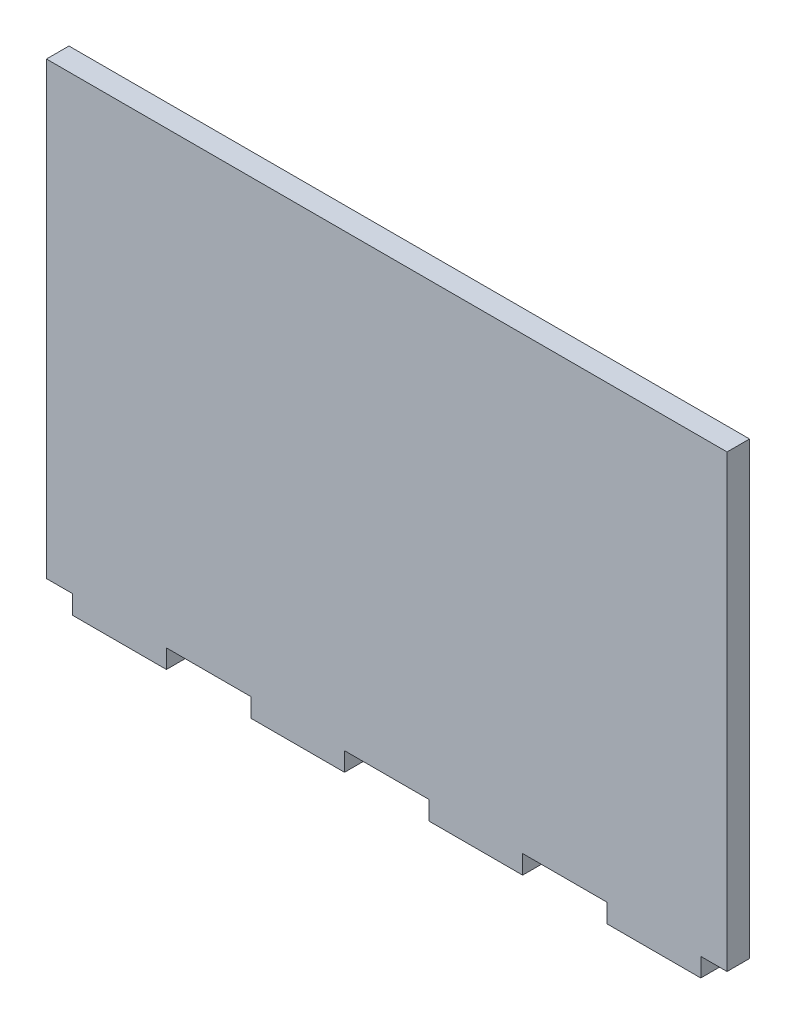
ISO-10303-21;
HEADER;
FILE_DESCRIPTION(('STEP AP214'),'2;1');
FILE_NAME('part.step','',(''),(''),'','','');
FILE_SCHEMA(('AUTOMOTIVE_DESIGN { 1 0 10303 214 1 1 1 1 }'));
ENDSEC;
DATA;
#1=APPLICATION_CONTEXT('core data for automotive mechanical design processes');
#2=APPLICATION_PROTOCOL_DEFINITION('international standard','automotive_design',2000,#1);
#3=PRODUCT_CONTEXT('',#1,'mechanical');
#4=PRODUCT('Part','Part','',(#3));
#5=PRODUCT_RELATED_PRODUCT_CATEGORY('part','',(#4));
#6=PRODUCT_DEFINITION_FORMATION('','',#4);
#7=PRODUCT_DEFINITION_CONTEXT('part definition',#1,'design');
#8=PRODUCT_DEFINITION('design','',#6,#7);
#9=PRODUCT_DEFINITION_SHAPE('','',#8);
#10=(LENGTH_UNIT() NAMED_UNIT(*) SI_UNIT(.MILLI.,.METRE.));
#11=(NAMED_UNIT(*) PLANE_ANGLE_UNIT() SI_UNIT($,.RADIAN.));
#12=(NAMED_UNIT(*) SI_UNIT($,.STERADIAN.) SOLID_ANGLE_UNIT());
#13=UNCERTAINTY_MEASURE_WITH_UNIT(LENGTH_MEASURE(1.E-05),#10,'distance_accuracy_value','');
#14=(GEOMETRIC_REPRESENTATION_CONTEXT(3) GLOBAL_UNCERTAINTY_ASSIGNED_CONTEXT((#13)) GLOBAL_UNIT_ASSIGNED_CONTEXT((#10,
#11,#12)) REPRESENTATION_CONTEXT('',''));
#15=CARTESIAN_POINT('',(0.,0.,0.));
#16=DIRECTION('',(0.,0.,1.));
#17=DIRECTION('',(1.,0.,0.));
#18=AXIS2_PLACEMENT_3D('',#15,#16,#17);
#19=CARTESIAN_POINT('',(64.4599453271027,0.,6.));
#20=DIRECTION('',(1.,0.,0.));
#21=DIRECTION('',(0.,1.,0.));
#22=AXIS2_PLACEMENT_3D('',#19,#20,#21);
#23=PLANE('',#22);
#24=DIRECTION('',(0.,-1.,0.));
#25=VECTOR('',#24,1.);
#26=CARTESIAN_POINT('',(64.4599453271027,0.,0.));
#27=LINE('',#26,#25);
#28=CARTESIAN_POINT('',(64.4599453271027,98.2674,0.));
#29=VERTEX_POINT('',#28);
#30=CARTESIAN_POINT('',(64.4599453271027,-21.7326,0.));
#31=VERTEX_POINT('',#30);
#32=EDGE_CURVE('E201',#29,#31,#27,.T.);
#33=ORIENTED_EDGE('',*,*,#32,.F.);
#34=DIRECTION('',(0.,0.,-1.));
#35=VECTOR('',#34,1.);
#36=CARTESIAN_POINT('',(64.4599453271027,98.2674,6.));
#37=LINE('',#36,#35);
#38=CARTESIAN_POINT('',(64.4599453271027,98.2674,6.));
#39=VERTEX_POINT('',#38);
#40=EDGE_CURVE('E11',#39,#29,#37,.T.);
#41=ORIENTED_EDGE('',*,*,#40,.F.);
#42=DIRECTION('',(0.,-1.,0.));
#43=VECTOR('',#42,1.);
#44=CARTESIAN_POINT('',(64.4599453271027,0.,6.));
#45=LINE('',#44,#43);
#46=CARTESIAN_POINT('',(64.4599453271027,-21.7326,6.));
#47=VERTEX_POINT('',#46);
#48=EDGE_CURVE('E298',#39,#47,#45,.T.);
#49=ORIENTED_EDGE('',*,*,#48,.T.);
#50=DIRECTION('',(0.,0.,-1.));
#51=VECTOR('',#50,1.);
#52=CARTESIAN_POINT('',(64.4599453271027,-21.7326,6.));
#53=LINE('',#52,#51);
#54=EDGE_CURVE('E120',#47,#31,#53,.T.);
#55=ORIENTED_EDGE('',*,*,#54,.T.);
#56=EDGE_LOOP('',(#33,#41,#49,#55));
#57=FACE_BOUND('',#56,.T.);
#58=ADVANCED_FACE('F34',(#57),#23,.T.);
#59=CARTESIAN_POINT('',(0.,98.2674,6.));
#60=DIRECTION('',(0.,1.,0.));
#61=DIRECTION('',(0.,0.,1.));
#62=AXIS2_PLACEMENT_3D('',#59,#60,#61);
#63=PLANE('',#62);
#64=DIRECTION('',(1.,0.,0.));
#65=VECTOR('',#64,1.);
#66=CARTESIAN_POINT('',(0.,98.2674,0.));
#67=LINE('',#66,#65);
#68=CARTESIAN_POINT('',(-117.040054672897,98.2674,0.));
#69=VERTEX_POINT('',#68);
#70=EDGE_CURVE('E204',#69,#29,#67,.T.);
#71=ORIENTED_EDGE('',*,*,#70,.F.);
#72=DIRECTION('',(0.,0.,-1.));
#73=VECTOR('',#72,1.);
#74=CARTESIAN_POINT('',(-117.040054672897,98.2674,6.));
#75=LINE('',#74,#73);
#76=CARTESIAN_POINT('',(-117.040054672897,98.2674,6.));
#77=VERTEX_POINT('',#76);
#78=EDGE_CURVE('E42',#77,#69,#75,.T.);
#79=ORIENTED_EDGE('',*,*,#78,.F.);
#80=DIRECTION('',(1.,0.,0.));
#81=VECTOR('',#80,1.);
#82=CARTESIAN_POINT('',(0.,98.2674,6.));
#83=LINE('',#82,#81);
#84=EDGE_CURVE('E297',#77,#39,#83,.T.);
#85=ORIENTED_EDGE('',*,*,#84,.T.);
#86=ORIENTED_EDGE('',*,*,#40,.T.);
#87=EDGE_LOOP('',(#71,#79,#85,#86));
#88=FACE_BOUND('',#87,.T.);
#89=ADVANCED_FACE('F296',(#88),#63,.T.);
#90=CARTESIAN_POINT('',(-117.040054672897,0.,6.));
#91=DIRECTION('',(1.,0.,0.));
#92=DIRECTION('',(0.,0.,-1.));
#93=AXIS2_PLACEMENT_3D('',#90,#91,#92);
#94=PLANE('',#93);
#95=DIRECTION('',(0.,-1.,0.));
#96=VECTOR('',#95,1.);
#97=CARTESIAN_POINT('',(-117.040054672897,0.,0.));
#98=LINE('',#97,#96);
#99=CARTESIAN_POINT('',(-117.040054672897,-21.7326,0.));
#100=VERTEX_POINT('',#99);
#101=EDGE_CURVE('E207',#69,#100,#98,.T.);
#102=ORIENTED_EDGE('',*,*,#101,.T.);
#103=DIRECTION('',(0.,0.,-1.));
#104=VECTOR('',#103,1.);
#105=CARTESIAN_POINT('',(-117.040054672897,-21.7326,6.));
#106=LINE('',#105,#104);
#107=CARTESIAN_POINT('',(-117.040054672897,-21.7326,6.));
#108=VERTEX_POINT('',#107);
#109=EDGE_CURVE('E280',#108,#100,#106,.T.);
#110=ORIENTED_EDGE('',*,*,#109,.F.);
#111=DIRECTION('',(0.,-1.,0.));
#112=VECTOR('',#111,1.);
#113=CARTESIAN_POINT('',(-117.040054672897,0.,6.));
#114=LINE('',#113,#112);
#115=EDGE_CURVE('E287',#77,#108,#114,.T.);
#116=ORIENTED_EDGE('',*,*,#115,.F.);
#117=ORIENTED_EDGE('',*,*,#78,.T.);
#118=EDGE_LOOP('',(#102,#110,#116,#117));
#119=FACE_BOUND('',#118,.T.);
#120=ADVANCED_FACE('F285',(#119),#94,.F.);
#121=CARTESIAN_POINT('',(0.,-21.7326,6.));
#122=DIRECTION('',(0.,1.,0.));
#123=DIRECTION('',(-1.,0.,0.));
#124=AXIS2_PLACEMENT_3D('',#121,#122,#123);
#125=PLANE('',#124);
#126=DIRECTION('',(1.,0.,0.));
#127=VECTOR('',#126,1.);
#128=CARTESIAN_POINT('',(0.,-21.7326,0.));
#129=LINE('',#128,#127);
#130=CARTESIAN_POINT('',(-110.030054672897,-21.7326,0.));
#131=VERTEX_POINT('',#130);
#132=EDGE_CURVE('E209',#100,#131,#129,.T.);
#133=ORIENTED_EDGE('',*,*,#132,.T.);
#134=DIRECTION('',(0.,0.,-1.));
#135=VECTOR('',#134,1.);
#136=CARTESIAN_POINT('',(-110.030054672897,-21.7326,6.));
#137=LINE('',#136,#135);
#138=CARTESIAN_POINT('',(-110.030054672897,-21.7326,6.));
#139=VERTEX_POINT('',#138);
#140=EDGE_CURVE('E277',#139,#131,#137,.T.);
#141=ORIENTED_EDGE('',*,*,#140,.F.);
#142=DIRECTION('',(1.,0.,0.));
#143=VECTOR('',#142,1.);
#144=CARTESIAN_POINT('',(0.,-21.7326,6.));
#145=LINE('',#144,#143);
#146=EDGE_CURVE('E198',#108,#139,#145,.T.);
#147=ORIENTED_EDGE('',*,*,#146,.F.);
#148=ORIENTED_EDGE('',*,*,#109,.T.);
#149=EDGE_LOOP('',(#133,#141,#147,#148));
#150=FACE_BOUND('',#149,.T.);
#151=ADVANCED_FACE('F355',(#150),#125,.F.);
#152=CARTESIAN_POINT('',(-110.030054672897,0.,6.));
#153=DIRECTION('',(1.,0.,0.));
#154=DIRECTION('',(0.,0.,-1.));
#155=AXIS2_PLACEMENT_3D('',#152,#153,#154);
#156=PLANE('',#155);
#157=DIRECTION('',(0.,-1.,0.));
#158=VECTOR('',#157,1.);
#159=CARTESIAN_POINT('',(-110.030054672897,0.,0.));
#160=LINE('',#159,#158);
#161=CARTESIAN_POINT('',(-110.030054672897,-26.7326,0.));
#162=VERTEX_POINT('',#161);
#163=EDGE_CURVE('E211',#131,#162,#160,.T.);
#164=ORIENTED_EDGE('',*,*,#163,.T.);
#165=DIRECTION('',(0.,0.,-1.));
#166=VECTOR('',#165,1.);
#167=CARTESIAN_POINT('',(-110.030054672897,-26.7326,6.));
#168=LINE('',#167,#166);
#169=CARTESIAN_POINT('',(-110.030054672897,-26.7326,6.));
#170=VERTEX_POINT('',#169);
#171=EDGE_CURVE('E274',#170,#162,#168,.T.);
#172=ORIENTED_EDGE('',*,*,#171,.F.);
#173=DIRECTION('',(0.,-1.,0.));
#174=VECTOR('',#173,1.);
#175=CARTESIAN_POINT('',(-110.030054672897,0.,6.));
#176=LINE('',#175,#174);
#177=EDGE_CURVE('E350',#139,#170,#176,.T.);
#178=ORIENTED_EDGE('',*,*,#177,.F.);
#179=ORIENTED_EDGE('',*,*,#140,.T.);
#180=EDGE_LOOP('',(#164,#172,#178,#179));
#181=FACE_BOUND('',#180,.T.);
#182=ADVANCED_FACE('F359',(#181),#156,.F.);
#183=CARTESIAN_POINT('',(0.,-26.7326,6.));
#184=DIRECTION('',(0.,1.,0.));
#185=DIRECTION('',(0.,0.,1.));
#186=AXIS2_PLACEMENT_3D('',#183,#184,#185);
#187=PLANE('',#186);
#188=DIRECTION('',(1.,0.,0.));
#189=VECTOR('',#188,1.);
#190=CARTESIAN_POINT('',(0.,-26.7326,0.));
#191=LINE('',#190,#189);
#192=CARTESIAN_POINT('',(-85.0500546728973,-26.7326,0.));
#193=VERTEX_POINT('',#192);
#194=EDGE_CURVE('E215',#162,#193,#191,.T.);
#195=ORIENTED_EDGE('',*,*,#194,.T.);
#196=DIRECTION('',(0.,0.,-1.));
#197=VECTOR('',#196,1.);
#198=CARTESIAN_POINT('',(-85.0500546728973,-26.7326,6.));
#199=LINE('',#198,#197);
#200=CARTESIAN_POINT('',(-85.0500546728973,-26.7326,6.));
#201=VERTEX_POINT('',#200);
#202=EDGE_CURVE('E272',#201,#193,#199,.T.);
#203=ORIENTED_EDGE('',*,*,#202,.F.);
#204=DIRECTION('',(1.,0.,0.));
#205=VECTOR('',#204,1.);
#206=CARTESIAN_POINT('',(0.,-26.7326,6.));
#207=LINE('',#206,#205);
#208=EDGE_CURVE('E349',#170,#201,#207,.T.);
#209=ORIENTED_EDGE('',*,*,#208,.F.);
#210=ORIENTED_EDGE('',*,*,#171,.T.);
#211=EDGE_LOOP('',(#195,#203,#209,#210));
#212=FACE_BOUND('',#211,.T.);
#213=ADVANCED_FACE('F364',(#212),#187,.F.);
#214=CARTESIAN_POINT('',(-85.0500546728972,2.36061322358697E-13,6.));
#215=DIRECTION('',(1.,0.,0.));
#216=DIRECTION('',(0.,1.,0.));
#217=AXIS2_PLACEMENT_3D('',#214,#215,#216);
#218=PLANE('',#217);
#219=DIRECTION('',(0.,-1.,0.));
#220=VECTOR('',#219,1.);
#221=CARTESIAN_POINT('',(-85.0500546728972,2.36061322358697E-13,0.));
#222=LINE('',#221,#220);
#223=CARTESIAN_POINT('',(-85.0500546728973,-21.7326,0.));
#224=VERTEX_POINT('',#223);
#225=EDGE_CURVE('E218',#224,#193,#222,.T.);
#226=ORIENTED_EDGE('',*,*,#225,.F.);
#227=DIRECTION('',(0.,0.,-1.));
#228=VECTOR('',#227,1.);
#229=CARTESIAN_POINT('',(-85.0500546728973,-21.7326,6.));
#230=LINE('',#229,#228);
#231=CARTESIAN_POINT('',(-85.0500546728973,-21.7326,6.));
#232=VERTEX_POINT('',#231);
#233=EDGE_CURVE('E270',#232,#224,#230,.T.);
#234=ORIENTED_EDGE('',*,*,#233,.F.);
#235=DIRECTION('',(0.,-1.,0.));
#236=VECTOR('',#235,1.);
#237=CARTESIAN_POINT('',(-85.0500546728972,2.36061322358697E-13,6.));
#238=LINE('',#237,#236);
#239=EDGE_CURVE('E346',#232,#201,#238,.T.);
#240=ORIENTED_EDGE('',*,*,#239,.T.);
#241=ORIENTED_EDGE('',*,*,#202,.T.);
#242=EDGE_LOOP('',(#226,#234,#240,#241));
#243=FACE_BOUND('',#242,.T.);
#244=ADVANCED_FACE('F367',(#243),#218,.T.);
#245=CARTESIAN_POINT('',(-62.5300546728973,-21.7326,0.));
#246=VERTEX_POINT('',#245);
#247=EDGE_CURVE('E213',#224,#246,#129,.T.);
#248=ORIENTED_EDGE('',*,*,#247,.T.);
#249=DIRECTION('',(0.,0.,-1.));
#250=VECTOR('',#249,1.);
#251=CARTESIAN_POINT('',(-62.5300546728973,-21.7326,6.));
#252=LINE('',#251,#250);
#253=CARTESIAN_POINT('',(-62.5300546728973,-21.7326,6.));
#254=VERTEX_POINT('',#253);
#255=EDGE_CURVE('E267',#254,#246,#252,.T.);
#256=ORIENTED_EDGE('',*,*,#255,.F.);
#257=EDGE_CURVE('E331',#232,#254,#145,.T.);
#258=ORIENTED_EDGE('',*,*,#257,.F.);
#259=ORIENTED_EDGE('',*,*,#233,.T.);
#260=EDGE_LOOP('',(#248,#256,#258,#259));
#261=FACE_BOUND('',#260,.T.);
#262=ADVANCED_FACE('F309',(#261),#125,.F.);
#263=CARTESIAN_POINT('',(-62.5300546728973,0.,6.));
#264=DIRECTION('',(1.,0.,0.));
#265=DIRECTION('',(0.,0.,-1.));
#266=AXIS2_PLACEMENT_3D('',#263,#264,#265);
#267=PLANE('',#266);
#268=DIRECTION('',(0.,-1.,0.));
#269=VECTOR('',#268,1.);
#270=CARTESIAN_POINT('',(-62.5300546728973,0.,0.));
#271=LINE('',#270,#269);
#272=CARTESIAN_POINT('',(-62.5300546728973,-26.7326,0.));
#273=VERTEX_POINT('',#272);
#274=EDGE_CURVE('E221',#246,#273,#271,.T.);
#275=ORIENTED_EDGE('',*,*,#274,.T.);
#276=DIRECTION('',(0.,0.,-1.));
#277=VECTOR('',#276,1.);
#278=CARTESIAN_POINT('',(-62.5300546728973,-26.7326,6.));
#279=LINE('',#278,#277);
#280=CARTESIAN_POINT('',(-62.5300546728973,-26.7326,6.));
#281=VERTEX_POINT('',#280);
#282=EDGE_CURVE('E264',#281,#273,#279,.T.);
#283=ORIENTED_EDGE('',*,*,#282,.F.);
#284=DIRECTION('',(0.,-1.,0.));
#285=VECTOR('',#284,1.);
#286=CARTESIAN_POINT('',(-62.5300546728973,0.,6.));
#287=LINE('',#286,#285);
#288=EDGE_CURVE('E317',#254,#281,#287,.T.);
#289=ORIENTED_EDGE('',*,*,#288,.F.);
#290=ORIENTED_EDGE('',*,*,#255,.T.);
#291=EDGE_LOOP('',(#275,#283,#289,#290));
#292=FACE_BOUND('',#291,.T.);
#293=ADVANCED_FACE('F315',(#292),#267,.F.);
#294=CARTESIAN_POINT('',(0.,-26.7326,6.));
#295=DIRECTION('',(0.,1.,0.));
#296=DIRECTION('',(0.,0.,1.));
#297=AXIS2_PLACEMENT_3D('',#294,#295,#296);
#298=PLANE('',#297);
#299=DIRECTION('',(1.,0.,0.));
#300=VECTOR('',#299,1.);
#301=CARTESIAN_POINT('',(0.,-26.7326,0.));
#302=LINE('',#301,#300);
#303=CARTESIAN_POINT('',(-37.5500546728973,-26.7326,0.));
#304=VERTEX_POINT('',#303);
#305=EDGE_CURVE('E223',#273,#304,#302,.T.);
#306=ORIENTED_EDGE('',*,*,#305,.T.);
#307=DIRECTION('',(0.,0.,-1.));
#308=VECTOR('',#307,1.);
#309=CARTESIAN_POINT('',(-37.5500546728973,-26.7326,6.));
#310=LINE('',#309,#308);
#311=CARTESIAN_POINT('',(-37.5500546728973,-26.7326,6.));
#312=VERTEX_POINT('',#311);
#313=EDGE_CURVE('E262',#312,#304,#310,.T.);
#314=ORIENTED_EDGE('',*,*,#313,.F.);
#315=DIRECTION('',(1.,0.,0.));
#316=VECTOR('',#315,1.);
#317=CARTESIAN_POINT('',(0.,-26.7326,6.));
#318=LINE('',#317,#316);
#319=EDGE_CURVE('E325',#281,#312,#318,.T.);
#320=ORIENTED_EDGE('',*,*,#319,.F.);
#321=ORIENTED_EDGE('',*,*,#282,.T.);
#322=EDGE_LOOP('',(#306,#314,#320,#321));
#323=FACE_BOUND('',#322,.T.);
#324=ADVANCED_FACE('F322',(#323),#298,.F.);
#325=CARTESIAN_POINT('',(-37.5500546728973,0.,6.));
#326=DIRECTION('',(1.,0.,0.));
#327=DIRECTION('',(0.,1.,0.));
#328=AXIS2_PLACEMENT_3D('',#325,#326,#327);
#329=PLANE('',#328);
#330=DIRECTION('',(0.,-1.,0.));
#331=VECTOR('',#330,1.);
#332=CARTESIAN_POINT('',(-37.5500546728973,0.,0.));
#333=LINE('',#332,#331);
#334=CARTESIAN_POINT('',(-37.5500546728973,-21.7326,0.));
#335=VERTEX_POINT('',#334);
#336=EDGE_CURVE('E226',#335,#304,#333,.T.);
#337=ORIENTED_EDGE('',*,*,#336,.F.);
#338=DIRECTION('',(0.,0.,-1.));
#339=VECTOR('',#338,1.);
#340=CARTESIAN_POINT('',(-37.5500546728973,-21.7326,6.));
#341=LINE('',#340,#339);
#342=CARTESIAN_POINT('',(-37.5500546728973,-21.7326,6.));
#343=VERTEX_POINT('',#342);
#344=EDGE_CURVE('E260',#343,#335,#341,.T.);
#345=ORIENTED_EDGE('',*,*,#344,.F.);
#346=DIRECTION('',(0.,-1.,0.));
#347=VECTOR('',#346,1.);
#348=CARTESIAN_POINT('',(-37.5500546728973,0.,6.));
#349=LINE('',#348,#347);
#350=EDGE_CURVE('E327',#343,#312,#349,.T.);
#351=ORIENTED_EDGE('',*,*,#350,.T.);
#352=ORIENTED_EDGE('',*,*,#313,.T.);
#353=EDGE_LOOP('',(#337,#345,#351,#352));
#354=FACE_BOUND('',#353,.T.);
#355=ADVANCED_FACE('F417',(#354),#329,.T.);
#356=CARTESIAN_POINT('',(-15.0300546728973,-21.7326,0.));
#357=VERTEX_POINT('',#356);
#358=EDGE_CURVE('E229',#335,#357,#129,.T.);
#359=ORIENTED_EDGE('',*,*,#358,.T.);
#360=DIRECTION('',(0.,0.,-1.));
#361=VECTOR('',#360,1.);
#362=CARTESIAN_POINT('',(-15.0300546728973,-21.7326,6.));
#363=LINE('',#362,#361);
#364=CARTESIAN_POINT('',(-15.0300546728973,-21.7326,6.));
#365=VERTEX_POINT('',#364);
#366=EDGE_CURVE('E257',#365,#357,#363,.T.);
#367=ORIENTED_EDGE('',*,*,#366,.F.);
#368=EDGE_CURVE('E329',#343,#365,#145,.T.);
#369=ORIENTED_EDGE('',*,*,#368,.F.);
#370=ORIENTED_EDGE('',*,*,#344,.T.);
#371=EDGE_LOOP('',(#359,#367,#369,#370));
#372=FACE_BOUND('',#371,.T.);
#373=ADVANCED_FACE('F375',(#372),#125,.F.);
#374=CARTESIAN_POINT('',(-15.0300546728973,0.,6.));
#375=DIRECTION('',(1.,0.,0.));
#376=DIRECTION('',(0.,1.,0.));
#377=AXIS2_PLACEMENT_3D('',#374,#375,#376);
#378=PLANE('',#377);
#379=DIRECTION('',(0.,-1.,0.));
#380=VECTOR('',#379,1.);
#381=CARTESIAN_POINT('',(-15.0300546728973,0.,0.));
#382=LINE('',#381,#380);
#383=CARTESIAN_POINT('',(-15.0300546728973,-26.7326,0.));
#384=VERTEX_POINT('',#383);
#385=EDGE_CURVE('E230',#357,#384,#382,.T.);
#386=ORIENTED_EDGE('',*,*,#385,.T.);
#387=DIRECTION('',(0.,0.,-1.));
#388=VECTOR('',#387,1.);
#389=CARTESIAN_POINT('',(-15.0300546728973,-26.7326,6.));
#390=LINE('',#389,#388);
#391=CARTESIAN_POINT('',(-15.0300546728973,-26.7326,6.));
#392=VERTEX_POINT('',#391);
#393=EDGE_CURVE('E254',#392,#384,#390,.T.);
#394=ORIENTED_EDGE('',*,*,#393,.F.);
#395=DIRECTION('',(0.,-1.,0.));
#396=VECTOR('',#395,1.);
#397=CARTESIAN_POINT('',(-15.0300546728973,0.,6.));
#398=LINE('',#397,#396);
#399=EDGE_CURVE('E335',#365,#392,#398,.T.);
#400=ORIENTED_EDGE('',*,*,#399,.F.);
#401=ORIENTED_EDGE('',*,*,#366,.T.);
#402=EDGE_LOOP('',(#386,#394,#400,#401));
#403=FACE_BOUND('',#402,.T.);
#404=ADVANCED_FACE('F416',(#403),#378,.F.);
#405=CARTESIAN_POINT('',(0.,-26.7326,6.));
#406=DIRECTION('',(0.,1.,0.));
#407=DIRECTION('',(-1.,0.,0.));
#408=AXIS2_PLACEMENT_3D('',#405,#406,#407);
#409=PLANE('',#408);
#410=DIRECTION('',(1.,0.,0.));
#411=VECTOR('',#410,1.);
#412=CARTESIAN_POINT('',(0.,-26.7326,0.));
#413=LINE('',#412,#411);
#414=CARTESIAN_POINT('',(9.94994532710272,-26.7326,0.));
#415=VERTEX_POINT('',#414);
#416=EDGE_CURVE('E232',#384,#415,#413,.T.);
#417=ORIENTED_EDGE('',*,*,#416,.T.);
#418=DIRECTION('',(0.,0.,-1.));
#419=VECTOR('',#418,1.);
#420=CARTESIAN_POINT('',(9.94994532710272,-26.7326,6.));
#421=LINE('',#420,#419);
#422=CARTESIAN_POINT('',(9.94994532710272,-26.7326,6.));
#423=VERTEX_POINT('',#422);
#424=EDGE_CURVE('E252',#423,#415,#421,.T.);
#425=ORIENTED_EDGE('',*,*,#424,.F.);
#426=DIRECTION('',(1.,0.,0.));
#427=VECTOR('',#426,1.);
#428=CARTESIAN_POINT('',(0.,-26.7326,6.));
#429=LINE('',#428,#427);
#430=EDGE_CURVE('E337',#392,#423,#429,.T.);
#431=ORIENTED_EDGE('',*,*,#430,.F.);
#432=ORIENTED_EDGE('',*,*,#393,.T.);
#433=EDGE_LOOP('',(#417,#425,#431,#432));
#434=FACE_BOUND('',#433,.T.);
#435=ADVANCED_FACE('F412',(#434),#409,.F.);
#436=CARTESIAN_POINT('',(9.94994532710269,0.,6.));
#437=DIRECTION('',(1.,0.,0.));
#438=DIRECTION('',(0.,1.,0.));
#439=AXIS2_PLACEMENT_3D('',#436,#437,#438);
#440=PLANE('',#439);
#441=DIRECTION('',(0.,-1.,0.));
#442=VECTOR('',#441,1.);
#443=CARTESIAN_POINT('',(9.94994532710269,0.,0.));
#444=LINE('',#443,#442);
#445=CARTESIAN_POINT('',(9.94994532710271,-21.7326,0.));
#446=VERTEX_POINT('',#445);
#447=EDGE_CURVE('E235',#446,#415,#444,.T.);
#448=ORIENTED_EDGE('',*,*,#447,.F.);
#449=DIRECTION('',(0.,0.,-1.));
#450=VECTOR('',#449,1.);
#451=CARTESIAN_POINT('',(9.94994532710271,-21.7326,6.));
#452=LINE('',#451,#450);
#453=CARTESIAN_POINT('',(9.94994532710271,-21.7326,6.));
#454=VERTEX_POINT('',#453);
#455=EDGE_CURVE('E250',#454,#446,#452,.T.);
#456=ORIENTED_EDGE('',*,*,#455,.F.);
#457=DIRECTION('',(0.,-1.,0.));
#458=VECTOR('',#457,1.);
#459=CARTESIAN_POINT('',(9.94994532710269,0.,6.));
#460=LINE('',#459,#458);
#461=EDGE_CURVE('E339',#454,#423,#460,.T.);
#462=ORIENTED_EDGE('',*,*,#461,.T.);
#463=ORIENTED_EDGE('',*,*,#424,.T.);
#464=EDGE_LOOP('',(#448,#456,#462,#463));
#465=FACE_BOUND('',#464,.T.);
#466=ADVANCED_FACE('F405',(#465),#440,.T.);
#467=CARTESIAN_POINT('',(32.4699453271027,-21.7326,0.));
#468=VERTEX_POINT('',#467);
#469=EDGE_CURVE('E238',#446,#468,#129,.T.);
#470=ORIENTED_EDGE('',*,*,#469,.T.);
#471=DIRECTION('',(0.,0.,-1.));
#472=VECTOR('',#471,1.);
#473=CARTESIAN_POINT('',(32.4699453271027,-21.7326,6.));
#474=LINE('',#473,#472);
#475=CARTESIAN_POINT('',(32.4699453271027,-21.7326,6.));
#476=VERTEX_POINT('',#475);
#477=EDGE_CURVE('E247',#476,#468,#474,.T.);
#478=ORIENTED_EDGE('',*,*,#477,.F.);
#479=EDGE_CURVE('E197',#454,#476,#145,.T.);
#480=ORIENTED_EDGE('',*,*,#479,.F.);
#481=ORIENTED_EDGE('',*,*,#455,.T.);
#482=EDGE_LOOP('',(#470,#478,#480,#481));
#483=FACE_BOUND('',#482,.T.);
#484=ADVANCED_FACE('F397',(#483),#125,.F.);
#485=CARTESIAN_POINT('',(32.4699453271027,0.,6.));
#486=DIRECTION('',(1.,0.,0.));
#487=DIRECTION('',(0.,1.,0.));
#488=AXIS2_PLACEMENT_3D('',#485,#486,#487);
#489=PLANE('',#488);
#490=DIRECTION('',(0.,-1.,0.));
#491=VECTOR('',#490,1.);
#492=CARTESIAN_POINT('',(32.4699453271027,0.,0.));
#493=LINE('',#492,#491);
#494=CARTESIAN_POINT('',(32.4699453271027,-26.7326,0.));
#495=VERTEX_POINT('',#494);
#496=EDGE_CURVE('E239',#468,#495,#493,.T.);
#497=ORIENTED_EDGE('',*,*,#496,.T.);
#498=DIRECTION('',(0.,0.,-1.));
#499=VECTOR('',#498,1.);
#500=CARTESIAN_POINT('',(32.4699453271027,-26.7326,6.));
#501=LINE('',#500,#499);
#502=CARTESIAN_POINT('',(32.4699453271027,-26.7326,6.));
#503=VERTEX_POINT('',#502);
#504=EDGE_CURVE('E192',#503,#495,#501,.T.);
#505=ORIENTED_EDGE('',*,*,#504,.F.);
#506=DIRECTION('',(0.,-1.,0.));
#507=VECTOR('',#506,1.);
#508=CARTESIAN_POINT('',(32.4699453271027,0.,6.));
#509=LINE('',#508,#507);
#510=EDGE_CURVE('E179',#476,#503,#509,.T.);
#511=ORIENTED_EDGE('',*,*,#510,.F.);
#512=ORIENTED_EDGE('',*,*,#477,.T.);
#513=EDGE_LOOP('',(#497,#505,#511,#512));
#514=FACE_BOUND('',#513,.T.);
#515=ADVANCED_FACE('F404',(#514),#489,.F.);
#516=CARTESIAN_POINT('',(0.,-26.7326,6.));
#517=DIRECTION('',(0.,1.,0.));
#518=DIRECTION('',(-1.,0.,0.));
#519=AXIS2_PLACEMENT_3D('',#516,#517,#518);
#520=PLANE('',#519);
#521=DIRECTION('',(1.,0.,0.));
#522=VECTOR('',#521,1.);
#523=CARTESIAN_POINT('',(0.,-26.7326,0.));
#524=LINE('',#523,#522);
#525=CARTESIAN_POINT('',(57.4499453271027,-26.7325999999999,0.));
#526=VERTEX_POINT('',#525);
#527=EDGE_CURVE('E188',#495,#526,#524,.T.);
#528=ORIENTED_EDGE('',*,*,#527,.T.);
#529=DIRECTION('',(0.,0.,-1.));
#530=VECTOR('',#529,1.);
#531=CARTESIAN_POINT('',(57.4499453271027,-26.7325999999999,6.));
#532=LINE('',#531,#530);
#533=CARTESIAN_POINT('',(57.4499453271027,-26.7325999999999,6.));
#534=VERTEX_POINT('',#533);
#535=EDGE_CURVE('E185',#534,#526,#532,.T.);
#536=ORIENTED_EDGE('',*,*,#535,.F.);
#537=DIRECTION('',(1.,0.,0.));
#538=VECTOR('',#537,1.);
#539=CARTESIAN_POINT('',(0.,-26.7326,6.));
#540=LINE('',#539,#538);
#541=EDGE_CURVE('E173',#503,#534,#540,.T.);
#542=ORIENTED_EDGE('',*,*,#541,.F.);
#543=ORIENTED_EDGE('',*,*,#504,.T.);
#544=EDGE_LOOP('',(#528,#536,#542,#543));
#545=FACE_BOUND('',#544,.T.);
#546=ADVANCED_FACE('F186',(#545),#520,.F.);
#547=CARTESIAN_POINT('',(57.4499453271027,0.,6.));
#548=DIRECTION('',(1.,0.,0.));
#549=DIRECTION('',(0.,1.,0.));
#550=AXIS2_PLACEMENT_3D('',#547,#548,#549);
#551=PLANE('',#550);
#552=DIRECTION('',(0.,-1.,0.));
#553=VECTOR('',#552,1.);
#554=CARTESIAN_POINT('',(57.4499453271027,0.,0.));
#555=LINE('',#554,#553);
#556=CARTESIAN_POINT('',(57.4499453271027,-21.7326,0.));
#557=VERTEX_POINT('',#556);
#558=EDGE_CURVE('E242',#557,#526,#555,.T.);
#559=ORIENTED_EDGE('',*,*,#558,.F.);
#560=DIRECTION('',(0.,0.,-1.));
#561=VECTOR('',#560,1.);
#562=CARTESIAN_POINT('',(57.4499453271027,-21.7326,6.));
#563=LINE('',#562,#561);
#564=CARTESIAN_POINT('',(57.4499453271027,-21.7326,6.));
#565=VERTEX_POINT('',#564);
#566=EDGE_CURVE('E113',#565,#557,#563,.T.);
#567=ORIENTED_EDGE('',*,*,#566,.F.);
#568=DIRECTION('',(0.,-1.,0.));
#569=VECTOR('',#568,1.);
#570=CARTESIAN_POINT('',(57.4499453271027,0.,6.));
#571=LINE('',#570,#569);
#572=EDGE_CURVE('E177',#565,#534,#571,.T.);
#573=ORIENTED_EDGE('',*,*,#572,.T.);
#574=ORIENTED_EDGE('',*,*,#535,.T.);
#575=EDGE_LOOP('',(#559,#567,#573,#574));
#576=FACE_BOUND('',#575,.T.);
#577=ADVANCED_FACE('F194',(#576),#551,.T.);
#578=EDGE_CURVE('E212',#557,#31,#129,.T.);
#579=ORIENTED_EDGE('',*,*,#578,.T.);
#580=ORIENTED_EDGE('',*,*,#54,.F.);
#581=EDGE_CURVE('E50',#565,#47,#145,.T.);
#582=ORIENTED_EDGE('',*,*,#581,.F.);
#583=ORIENTED_EDGE('',*,*,#566,.T.);
#584=EDGE_LOOP('',(#579,#580,#582,#583));
#585=FACE_BOUND('',#584,.T.);
#586=ADVANCED_FACE('F391',(#585),#125,.F.);
#587=CARTESIAN_POINT('',(0.,0.,6.));
#588=DIRECTION('',(0.,0.,1.));
#589=DIRECTION('',(1.,0.,0.));
#590=AXIS2_PLACEMENT_3D('',#587,#588,#589);
#591=PLANE('',#590);
#592=ORIENTED_EDGE('',*,*,#48,.F.);
#593=ORIENTED_EDGE('',*,*,#84,.F.);
#594=ORIENTED_EDGE('',*,*,#115,.T.);
#595=ORIENTED_EDGE('',*,*,#146,.T.);
#596=ORIENTED_EDGE('',*,*,#177,.T.);
#597=ORIENTED_EDGE('',*,*,#208,.T.);
#598=ORIENTED_EDGE('',*,*,#239,.F.);
#599=ORIENTED_EDGE('',*,*,#257,.T.);
#600=ORIENTED_EDGE('',*,*,#288,.T.);
#601=ORIENTED_EDGE('',*,*,#319,.T.);
#602=ORIENTED_EDGE('',*,*,#350,.F.);
#603=ORIENTED_EDGE('',*,*,#368,.T.);
#604=ORIENTED_EDGE('',*,*,#399,.T.);
#605=ORIENTED_EDGE('',*,*,#430,.T.);
#606=ORIENTED_EDGE('',*,*,#461,.F.);
#607=ORIENTED_EDGE('',*,*,#479,.T.);
#608=ORIENTED_EDGE('',*,*,#510,.T.);
#609=ORIENTED_EDGE('',*,*,#541,.T.);
#610=ORIENTED_EDGE('',*,*,#572,.F.);
#611=ORIENTED_EDGE('',*,*,#581,.T.);
#612=EDGE_LOOP('',(#592,#593,#594,#595,#596,#597,#598,#599,#600,#601,#602,#603,#604,#605,#606,
#607,#608,#609,#610,#611));
#613=FACE_BOUND('',#612,.T.);
#614=ADVANCED_FACE('F175',(#613),#591,.T.);
#615=CARTESIAN_POINT('',(0.,0.,0.));
#616=DIRECTION('',(0.,0.,1.));
#617=DIRECTION('',(1.,0.,0.));
#618=AXIS2_PLACEMENT_3D('',#615,#616,#617);
#619=PLANE('',#618);
#620=ORIENTED_EDGE('',*,*,#32,.T.);
#621=ORIENTED_EDGE('',*,*,#578,.F.);
#622=ORIENTED_EDGE('',*,*,#558,.T.);
#623=ORIENTED_EDGE('',*,*,#527,.F.);
#624=ORIENTED_EDGE('',*,*,#496,.F.);
#625=ORIENTED_EDGE('',*,*,#469,.F.);
#626=ORIENTED_EDGE('',*,*,#447,.T.);
#627=ORIENTED_EDGE('',*,*,#416,.F.);
#628=ORIENTED_EDGE('',*,*,#385,.F.);
#629=ORIENTED_EDGE('',*,*,#358,.F.);
#630=ORIENTED_EDGE('',*,*,#336,.T.);
#631=ORIENTED_EDGE('',*,*,#305,.F.);
#632=ORIENTED_EDGE('',*,*,#274,.F.);
#633=ORIENTED_EDGE('',*,*,#247,.F.);
#634=ORIENTED_EDGE('',*,*,#225,.T.);
#635=ORIENTED_EDGE('',*,*,#194,.F.);
#636=ORIENTED_EDGE('',*,*,#163,.F.);
#637=ORIENTED_EDGE('',*,*,#132,.F.);
#638=ORIENTED_EDGE('',*,*,#101,.F.);
#639=ORIENTED_EDGE('',*,*,#70,.T.);
#640=EDGE_LOOP('',(#620,#621,#622,#623,#624,#625,#626,#627,#628,#629,#630,#631,#632,#633,#634,
#635,#636,#637,#638,#639));
#641=FACE_BOUND('',#640,.T.);
#642=ADVANCED_FACE('F294',(#641),#619,.F.);
#643=CLOSED_SHELL('',(#58,#89,#120,#151,#182,#213,#244,#262,#293,#324,#355,#373,#404,#435,#466,
#484,#515,#546,#577,#586,#614,#642));
#644=MANIFOLD_SOLID_BREP('B2',#643);
#645=ADVANCED_BREP_SHAPE_REPRESENTATION('',(#18,#644),#14);
#646=SHAPE_DEFINITION_REPRESENTATION(#9,#645);
ENDSEC;
END-ISO-10303-21;
